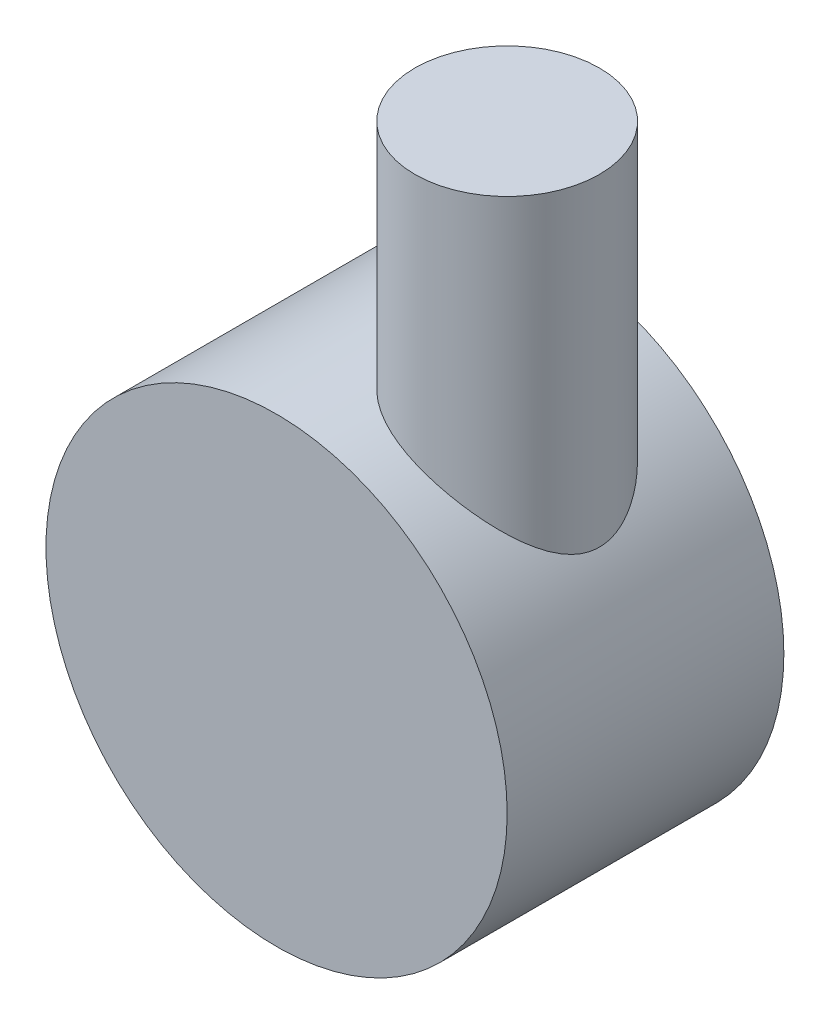
ISO-10303-21;
HEADER;
FILE_DESCRIPTION(('STEP AP214'),'2;1');
FILE_NAME('part.step','',(''),(''),'','','');
FILE_SCHEMA(('AUTOMOTIVE_DESIGN { 1 0 10303 214 1 1 1 1 }'));
ENDSEC;
DATA;
#1=APPLICATION_CONTEXT('core data for automotive mechanical design processes');
#2=APPLICATION_PROTOCOL_DEFINITION('international standard','automotive_design',2000,#1);
#3=PRODUCT_CONTEXT('',#1,'mechanical');
#4=PRODUCT('Part','Part','',(#3));
#5=PRODUCT_RELATED_PRODUCT_CATEGORY('part','',(#4));
#6=PRODUCT_DEFINITION_FORMATION('','',#4);
#7=PRODUCT_DEFINITION_CONTEXT('part definition',#1,'design');
#8=PRODUCT_DEFINITION('design','',#6,#7);
#9=PRODUCT_DEFINITION_SHAPE('','',#8);
#10=(LENGTH_UNIT() NAMED_UNIT(*) SI_UNIT(.MILLI.,.METRE.));
#11=(NAMED_UNIT(*) PLANE_ANGLE_UNIT() SI_UNIT($,.RADIAN.));
#12=(NAMED_UNIT(*) SI_UNIT($,.STERADIAN.) SOLID_ANGLE_UNIT());
#13=UNCERTAINTY_MEASURE_WITH_UNIT(LENGTH_MEASURE(1.E-05),#10,'distance_accuracy_value','');
#14=(GEOMETRIC_REPRESENTATION_CONTEXT(3) GLOBAL_UNCERTAINTY_ASSIGNED_CONTEXT((#13)) GLOBAL_UNIT_ASSIGNED_CONTEXT((#10,
#11,#12)) REPRESENTATION_CONTEXT('',''));
#15=CARTESIAN_POINT('',(0.,0.,0.));
#16=DIRECTION('',(0.,0.,1.));
#17=DIRECTION('',(1.,0.,0.));
#18=AXIS2_PLACEMENT_3D('',#15,#16,#17);
#19=CARTESIAN_POINT('',(0.,0.,30.));
#20=DIRECTION('',(0.,0.,-1.));
#21=DIRECTION('',(-1.,0.,0.));
#22=AXIS2_PLACEMENT_3D('',#19,#20,#21);
#23=CYLINDRICAL_SURFACE('',#22,25.);
#24=CARTESIAN_POINT('',(0.,0.,0.));
#25=DIRECTION('',(0.,0.,1.));
#26=DIRECTION('',(1.,0.,0.));
#27=AXIS2_PLACEMENT_3D('',#24,#25,#26);
#28=CIRCLE('',#27,25.);
#29=CARTESIAN_POINT('',(25.,0.,0.));
#30=VERTEX_POINT('',#29);
#31=EDGE_CURVE('E45',#30,#30,#28,.T.);
#32=ORIENTED_EDGE('',*,*,#31,.T.);
#33=EDGE_LOOP('',(#32));
#34=FACE_BOUND('',#33,.T.);
#35=CARTESIAN_POINT('',(0.,0.,30.));
#36=DIRECTION('',(0.,0.,1.));
#37=DIRECTION('',(1.,0.,0.));
#38=AXIS2_PLACEMENT_3D('',#35,#36,#37);
#39=CIRCLE('',#38,25.);
#40=CARTESIAN_POINT('',(25.,0.,30.));
#41=VERTEX_POINT('',#40);
#42=EDGE_CURVE('E41',#41,#41,#39,.T.);
#43=ORIENTED_EDGE('',*,*,#42,.F.);
#44=EDGE_LOOP('',(#43));
#45=FACE_BOUND('',#44,.T.);
#46=CARTESIAN_POINT('',(10.,22.9128784747792,5.));
#47=CARTESIAN_POINT('',(9.74395274865418,23.0246332525659,4.99999508158958));
#48=CARTESIAN_POINT('',(9.48607902975445,23.1320564122985,5.00983559358378));
#49=CARTESIAN_POINT('',(8.96819070452712,23.337717942223,5.04998592326425));
#50=CARTESIAN_POINT('',(8.70817595497397,23.4359556924302,5.08029712152034));
#51=CARTESIAN_POINT('',(8.18791942694949,23.6227519062562,5.16202649364371));
#52=CARTESIAN_POINT('',(7.92767761374418,23.7113084514143,5.21344884140283));
#53=CARTESIAN_POINT('',(7.40911530519431,23.8784255566922,5.33778513810004));
#54=CARTESIAN_POINT('',(7.15079476522745,23.956986349654,5.41069858629105));
#55=CARTESIAN_POINT('',(6.63763420053793,24.1042165813292,5.5783470512476));
#56=CARTESIAN_POINT('',(6.38280508943463,24.1728595197061,5.67313883514075));
#57=CARTESIAN_POINT('',(5.87963571849291,24.3001489018193,5.88424264824561));
#58=CARTESIAN_POINT('',(5.63129554892842,24.3587952065456,6.00055497666871));
#59=CARTESIAN_POINT('',(5.14342377321489,24.4664587459752,6.25418660270448));
#60=CARTESIAN_POINT('',(4.90389179288228,24.5154763901018,6.39150500666943));
#61=CARTESIAN_POINT('',(4.4358484301732,24.6044712133675,6.6863538318722));
#62=CARTESIAN_POINT('',(4.20733675791638,24.6444486304048,6.84388372106369));
#63=CARTESIAN_POINT('',(3.77222382882678,24.7147115208709,7.17146248080796));
#64=CARTESIAN_POINT('',(3.5651129479655,24.7453186449425,7.34076649460857));
#65=CARTESIAN_POINT('',(3.16464943892371,24.7997143878116,7.69591857548004));
#66=CARTESIAN_POINT('',(2.97129642145454,24.823503199596,7.881766174103));
#67=CARTESIAN_POINT('',(2.59984571501325,24.8651511924953,8.26875510810559));
#68=CARTESIAN_POINT('',(2.42174885604364,24.8830100511465,8.46989727445502));
#69=CARTESIAN_POINT('',(2.0821532878917,24.9137254390399,8.88609421418228));
#70=CARTESIAN_POINT('',(1.92065491953421,24.9265818655799,9.10114927309258));
#71=CARTESIAN_POINT('',(1.61334163370636,24.9483704951518,9.54672564337698));
#72=CARTESIAN_POINT('',(1.46777049381967,24.9572468205724,9.77741781204359));
#73=CARTESIAN_POINT('',(1.19592229118368,24.9717501726439,10.2499971596258));
#74=CARTESIAN_POINT('',(1.06964531974725,24.9773771839174,10.4918843915169));
#75=CARTESIAN_POINT('',(0.837254016077246,24.9862469332782,10.9852224168203));
#76=CARTESIAN_POINT('',(0.731141326829147,24.9894894771409,11.2366739875331));
#77=CARTESIAN_POINT('',(0.539814508538939,24.9943546255284,11.7474223159099));
#78=CARTESIAN_POINT('',(0.45460070039668,24.9959772051801,12.0067191939689));
#79=CARTESIAN_POINT('',(0.303818883036969,24.9982704995468,12.5378589418796));
#80=CARTESIAN_POINT('',(0.238784437884012,24.9989168723248,12.8098535377182));
#81=CARTESIAN_POINT('',(0.131716648618825,24.9997103983013,13.3583358713078));
#82=CARTESIAN_POINT('',(0.0896836742488122,24.999857543475,13.6348236812124));
#83=CARTESIAN_POINT('',(0.0289138305584678,25.0000018026477,14.1903579759888));
#84=CARTESIAN_POINT('',(0.010177765900636,24.9999989114647,14.4694045489034));
#85=CARTESIAN_POINT('',(-0.00386387315887531,25.0000006898979,15.0280859044924));
#86=CARTESIAN_POINT('',(0.00083054374174687,25.0000053595112,15.3077206869484));
#87=CARTESIAN_POINT('',(0.0337154052949025,24.999982706367,15.8672888156708));
#88=CARTESIAN_POINT('',(0.062046504501513,24.9999551916958,16.1472139063603));
#89=CARTESIAN_POINT('',(0.142186774767194,24.9996276942589,16.7036841869424));
#90=CARTESIAN_POINT('',(0.193996097084954,24.9993277097379,16.9802293550481));
#91=CARTESIAN_POINT('',(0.320727905110784,24.9980228120748,17.527987508592));
#92=CARTESIAN_POINT('',(0.39565171168319,24.9970178586436,17.7992001883657));
#93=CARTESIAN_POINT('',(0.568076587653266,24.9936935562444,18.3343436272858));
#94=CARTESIAN_POINT('',(0.665577629051098,24.9913742089065,18.5982743954626));
#95=CARTESIAN_POINT('',(0.882430596719307,24.9846567513175,19.1169054189177));
#96=CARTESIAN_POINT('',(1.0017775561422,24.9802591132239,19.3716077566183));
#97=CARTESIAN_POINT('',(1.26146555688823,24.9684919283459,19.8700076396493));
#98=CARTESIAN_POINT('',(1.40180664176727,24.9611223753957,20.113705162147));
#99=CARTESIAN_POINT('',(1.70242479747288,24.9424220595718,20.5883042165447));
#100=CARTESIAN_POINT('',(1.86270085820941,24.9310914973469,20.8192063959188));
#101=CARTESIAN_POINT('',(2.20195445941364,24.9034204110807,21.2665203035375));
#102=CARTESIAN_POINT('',(2.38093175439566,24.8870799527973,21.4829322219306));
#103=CARTESIAN_POINT('',(2.75404531724813,24.8485412378278,21.8973182696574));
#104=CARTESIAN_POINT('',(2.9479892948464,24.8264106573434,22.0954717972488));
#105=CARTESIAN_POINT('',(3.35116280741475,24.7752091024433,22.4745922686055));
#106=CARTESIAN_POINT('',(3.56039221670149,24.7461381850895,22.6555593536569));
#107=CARTESIAN_POINT('',(3.99228966791369,24.680140213751,22.9989694396401));
#108=CARTESIAN_POINT('',(4.21495415455758,24.6432152316876,23.1614173086605));
#109=CARTESIAN_POINT('',(4.67179642939499,24.5607039624333,23.4667421630612));
#110=CARTESIAN_POINT('',(4.90597394606191,24.5151178794355,23.6096196096953));
#111=CARTESIAN_POINT('',(5.37712485757223,24.4160370679226,23.8712810419954));
#112=CARTESIAN_POINT('',(5.61384302184403,24.3627951296408,23.9906208360291));
#113=CARTESIAN_POINT('',(6.09410870109695,24.2471201804534,24.20943233343));
#114=CARTESIAN_POINT('',(6.33765605692516,24.1846873835949,24.3089044993701));
#115=CARTESIAN_POINT('',(6.82948348168864,24.0504288324105,24.4876914135884));
#116=CARTESIAN_POINT('',(7.07776319429391,23.9786037829203,24.5670076731411));
#117=CARTESIAN_POINT('',(7.57702438796852,23.8255508578537,24.7054780048841));
#118=CARTESIAN_POINT('',(7.82800590594936,23.7443228536678,24.7646318012576));
#119=CARTESIAN_POINT('',(8.33185292477046,23.5722594832219,24.8632391276802));
#120=CARTESIAN_POINT('',(8.58472179903931,23.4813820244073,24.9026016583937));
#121=CARTESIAN_POINT('',(9.08936271921491,23.2906901601945,24.9616908578817));
#122=CARTESIAN_POINT('',(9.34113476814021,23.1908757794079,24.9814175807296));
#123=CARTESIAN_POINT('',(9.84199772501981,22.9827901759487,25.0018936452963));
#124=CARTESIAN_POINT('',(10.0910879397443,22.8745168237198,25.0026381926865));
#125=CARTESIAN_POINT('',(10.5851101827623,22.6501449674866,24.9859274412839));
#126=CARTESIAN_POINT('',(10.8300417003568,22.5340455109934,24.9684699234245));
#127=CARTESIAN_POINT('',(11.3362281404002,22.2839984613635,24.9138778200478));
#128=CARTESIAN_POINT('',(11.5969783052325,22.1493838459887,24.8751197297828));
#129=CARTESIAN_POINT('',(12.1107745568919,21.8726839635874,24.7781896280705));
#130=CARTESIAN_POINT('',(12.3638202546075,21.7305983202241,24.7200166378489));
#131=CARTESIAN_POINT('',(12.8611680957075,21.4399930902089,24.5854099759036));
#132=CARTESIAN_POINT('',(13.1054707435012,21.2914738758228,24.5089773595844));
#133=CARTESIAN_POINT('',(13.5845747716175,20.9890354683963,24.3389214890771));
#134=CARTESIAN_POINT('',(13.8193750437603,20.8351156494154,24.2452962368707));
#135=CARTESIAN_POINT('',(14.3166302463571,20.4972842648155,24.0250930754001));
#136=CARTESIAN_POINT('',(14.5772859836243,20.3126019307803,23.8956282107729));
#137=CARTESIAN_POINT('',(15.0841355852319,19.9391069835223,23.6159945945144));
#138=CARTESIAN_POINT('',(15.3303278735085,19.7502939232447,23.4658235925071));
#139=CARTESIAN_POINT('',(15.8082672082935,19.3698785822733,23.1453684226011));
#140=CARTESIAN_POINT('',(16.0399758041939,19.1782704151523,22.9750339249016));
#141=CARTESIAN_POINT('',(16.4877334498816,18.7947217067157,22.6152355035305));
#142=CARTESIAN_POINT('',(16.7037819146241,18.6027811532565,22.4257708658105));
#143=CARTESIAN_POINT('',(17.1524041040135,18.1907049647092,21.9967174412053));
#144=CARTESIAN_POINT('',(17.3822278483873,17.9708857706338,21.7539327783159));
#145=CARTESIAN_POINT('',(17.8191056982342,17.5377908677891,21.2429691020709));
#146=CARTESIAN_POINT('',(18.0261483364758,17.3245184930561,20.9747774249458));
#147=CARTESIAN_POINT('',(18.4149781350494,16.9106140882536,20.4133462959547));
#148=CARTESIAN_POINT('',(18.5968498076735,16.7099410600277,20.1201962763503));
#149=CARTESIAN_POINT('',(18.9333579718167,16.3276663649453,19.5074625903773));
#150=CARTESIAN_POINT('',(19.0880276603494,16.1460415627106,19.1879118534245));
#151=CARTESIAN_POINT('',(19.3659772447335,15.8115789279219,18.522451791384));
#152=CARTESIAN_POINT('',(19.4893813665267,15.6586278187583,18.1766541087715));
#153=CARTESIAN_POINT('',(19.6472806876957,15.4593532676996,17.639102429716));
#154=CARTESIAN_POINT('',(19.695371111926,15.3979647884125,17.4568216071079));
#155=CARTESIAN_POINT('',(19.7817463802927,15.28683917915,17.0865135370156));
#156=CARTESIAN_POINT('',(19.8200360327816,15.2370963367399,16.8984891582534));
#157=CARTESIAN_POINT('',(19.886469197961,15.1502932062234,16.5152561472572));
#158=CARTESIAN_POINT('',(19.9144829198531,15.1133954363575,16.3199877804574));
#159=CARTESIAN_POINT('',(19.9590169886476,15.0545346396183,15.9258976549048));
#160=CARTESIAN_POINT('',(19.975537890519,15.032570891607,15.7270760682067));
#161=CARTESIAN_POINT('',(19.9966231339882,15.0045119065283,15.3278097242987));
#162=CARTESIAN_POINT('',(20.0011956567653,14.9984058115786,15.1273661720441));
#163=CARTESIAN_POINT('',(19.9982721728689,15.0023037371357,14.7267347789778));
#164=CARTESIAN_POINT('',(19.9907771395091,15.0123064583791,14.5265469188464));
#165=CARTESIAN_POINT('',(19.965757539693,15.0455602383054,14.155331111477));
#166=CARTESIAN_POINT('',(19.9497257142127,15.0668376176094,13.9840194600934));
#167=CARTESIAN_POINT('',(19.9091345865824,15.1204321418829,13.6441315623869));
#168=CARTESIAN_POINT('',(19.8845727151729,15.1527526129966,13.4755561562555));
#169=CARTESIAN_POINT('',(19.7987193626499,15.2649839542951,12.9752921553192));
#170=CARTESIAN_POINT('',(19.7252584341572,15.3601671036439,12.6490417757568));
#171=CARTESIAN_POINT('',(19.5085882083351,15.6351434326781,11.8661135636857));
#172=CARTESIAN_POINT('',(19.3488233598691,15.8336636252182,11.4206792040886));
#173=CARTESIAN_POINT('',(19.0719841946985,16.1641716117304,10.7866110328464));
#174=CARTESIAN_POINT('',(18.9733001815306,16.2800273382293,10.580604782049));
#175=CARTESIAN_POINT('',(18.7644319840241,16.520331973926,10.1796518435617));
#176=CARTESIAN_POINT('',(18.6542478478792,16.6447808471118,9.98470510952976));
#177=CARTESIAN_POINT('',(18.3690289965591,16.9600320765832,9.51677346996898));
#178=CARTESIAN_POINT('',(18.1878178719171,17.1545773092772,9.25007560010521));
#179=CARTESIAN_POINT('',(17.8042110373327,17.5523939664708,8.73930362529875));
#180=CARTESIAN_POINT('',(17.6018059116221,17.7556692455731,8.49523966739974));
#181=CARTESIAN_POINT('',(17.1768661786795,18.1670807569094,8.02919536063701));
#182=CARTESIAN_POINT('',(16.9543118417536,18.3752216022306,7.80723711362116));
#183=CARTESIAN_POINT('',(16.4901553189445,18.7928778425755,7.38579483838895));
#184=CARTESIAN_POINT('',(16.2485561667124,19.0023930138276,7.18630724306669));
#185=CARTESIAN_POINT('',(15.7411459775722,19.4249281771274,6.80597290531021));
#186=CARTESIAN_POINT('',(15.474903070117,19.6379166191462,6.62566641745807));
#187=CARTESIAN_POINT('',(14.9238780195027,20.0598680580042,6.29026638966857));
#188=CARTESIAN_POINT('',(14.6390931918983,20.2688304662652,6.13517651193639));
#189=CARTESIAN_POINT('',(14.0526046421726,20.6797528577756,5.85220598124393));
#190=CARTESIAN_POINT('',(13.7509418448292,20.8817280082562,5.72426283418575));
#191=CARTESIAN_POINT('',(13.1314997323419,21.2767152131802,5.49723887742645));
#192=CARTESIAN_POINT('',(12.8137275372959,21.4697311564233,5.39814544496617));
#193=CARTESIAN_POINT('',(12.0923828006851,21.8856878005721,5.21279901935137));
#194=CARTESIAN_POINT('',(11.6852605080598,22.1059249365757,5.13411054720127));
#195=CARTESIAN_POINT('',(10.853804857406,22.5257962094963,5.02771546712297));
#196=CARTESIAN_POINT('',(10.4294717051932,22.7254305926899,5.00000824971991));
#197=CARTESIAN_POINT('',(10.,22.9128784747792,5.));
#198=B_SPLINE_CURVE_WITH_KNOTS('',3,(#46,#47,#48,#49,#50,#51,#52,#53,#54,#55,#56,#57,#58,#59,
#60,#61,#62,#63,#64,#65,#66,#67,#68,#69,#70,#71,#72,#73,#74,#75,#76,#77,#78,#79,#80,#81,#82,#83,
#84,#85,#86,#87,#88,#89,#90,#91,#92,#93,#94,#95,#96,#97,#98,#99,#100,#101,#102,#103,#104,#105,
#106,#107,#108,#109,#110,#111,#112,#113,#114,#115,#116,#117,#118,#119,#120,#121,#122,#123,#124,
#125,#126,#127,#128,#129,#130,#131,#132,#133,#134,#135,#136,#137,#138,#139,#140,#141,#142,#143,
#144,#145,#146,#147,#148,#149,#150,#151,#152,#153,#154,#155,#156,#157,#158,#159,#160,#161,#162,
#163,#164,#165,#166,#167,#168,#169,#170,#171,#172,#173,#174,#175,#176,#177,#178,#179,#180,#181,
#182,#183,#184,#185,#186,#187,#188,#189,#190,#191,#192,#193,#194,#195,#196,#197),.UNSPECIFIED.,
.T.,.F.,(4,2,2,2,2,2,2,2,2,2,2,2,2,2,2,2,2,2,2,2,2,2,2,2,2,2,2,2,2,2,2,2,2,2,2,2,2,2,2,2,2,2,2,
2,2,2,2,2,2,2,2,2,2,2,2,2,2,2,2,2,2,2,2,2,2,2,2,2,2,2,2,2,2,2,2,4),(0.,0.837788159371604,
1.67563282591446,2.51364322281906,3.35163409545173,4.19182422231219,5.03202603165398,
5.87219210677559,6.71233606993501,7.51914069018817,8.32592247223642,9.1327481189423,
9.93959032928129,10.7574301798282,11.5752739008194,12.3931842311611,13.2111071196332,
14.049106621251,14.8871195930809,15.7251615086159,16.5632031130589,17.4062675107335,
18.2493373399363,19.0924553548216,19.9355723240944,20.7784978414129,21.6214251075489,
22.4643096805881,23.3071831907145,24.1406139291886,24.9740378156107,25.8072421148552,
26.6404267729885,27.450632642352,28.2608196457005,29.0709458839102,29.8810832039749,
30.694912192494,31.5087389398645,32.3227712334433,33.1369027796749,34.0240095999085,
34.9111611491185,35.798261433462,36.6854648762592,37.7185171790472,38.7516818442332,
39.7874820252978,40.8233208827681,42.0221707422132,43.2216213274088,44.4169415993948,
45.6107928369353,46.7998234649034,47.3940561661109,47.9879967698387,48.5892000031416,
49.190374203328,49.791136665305,50.3918506749593,50.9113608021999,51.4310275423876,
52.4702893438946,54.0007951315262,54.7687428555973,55.536687361554,56.6648436942158,
57.7935033718274,58.9232804159102,60.0528778599134,61.2086987503204,62.3646873508086,
63.5179851788286,64.6707776377388,66.0760284616632,67.4812624858709),.UNSPECIFIED.);
#199=CARTESIAN_POINT('',(10.,22.9128784747792,5.));
#200=VERTEX_POINT('',#199);
#201=EDGE_CURVE('E10',#200,#200,#198,.T.);
#202=ORIENTED_EDGE('',*,*,#201,.F.);
#203=EDGE_LOOP('',(#202));
#204=FACE_BOUND('',#203,.T.);
#205=ADVANCED_FACE('F31',(#34,#45,#204),#23,.T.);
#206=CARTESIAN_POINT('',(0.,0.,30.));
#207=DIRECTION('',(0.,0.,1.));
#208=DIRECTION('',(1.,0.,0.));
#209=AXIS2_PLACEMENT_3D('',#206,#207,#208);
#210=PLANE('',#209);
#211=ORIENTED_EDGE('',*,*,#42,.T.);
#212=EDGE_LOOP('',(#211));
#213=FACE_BOUND('',#212,.T.);
#214=ADVANCED_FACE('F65',(#213),#210,.T.);
#215=CARTESIAN_POINT('',(0.,0.,0.));
#216=DIRECTION('',(0.,0.,1.));
#217=DIRECTION('',(1.,0.,0.));
#218=AXIS2_PLACEMENT_3D('',#215,#216,#217);
#219=PLANE('',#218);
#220=ORIENTED_EDGE('',*,*,#31,.F.);
#221=EDGE_LOOP('',(#220));
#222=FACE_BOUND('',#221,.T.);
#223=ADVANCED_FACE('F59',(#222),#219,.F.);
#224=CARTESIAN_POINT('',(10.,50.,15.));
#225=DIRECTION('',(0.,-1.,0.));
#226=DIRECTION('',(0.,0.,-1.));
#227=AXIS2_PLACEMENT_3D('',#224,#225,#226);
#228=CYLINDRICAL_SURFACE('',#227,10.);
#229=CARTESIAN_POINT('',(10.,50.,15.));
#230=DIRECTION('',(0.,1.,0.));
#231=DIRECTION('',(0.,0.,1.));
#232=AXIS2_PLACEMENT_3D('',#229,#230,#231);
#233=CIRCLE('',#232,10.);
#234=CARTESIAN_POINT('',(10.,50.,25.));
#235=VERTEX_POINT('',#234);
#236=EDGE_CURVE('E50',#235,#235,#233,.T.);
#237=ORIENTED_EDGE('',*,*,#236,.F.);
#238=EDGE_LOOP('',(#237));
#239=FACE_BOUND('',#238,.T.);
#240=ORIENTED_EDGE('',*,*,#201,.T.);
#241=EDGE_LOOP('',(#240));
#242=FACE_BOUND('',#241,.T.);
#243=ADVANCED_FACE('F57',(#239,#242),#228,.T.);
#244=CARTESIAN_POINT('',(10.,50.,15.));
#245=DIRECTION('',(0.,1.,0.));
#246=DIRECTION('',(0.,0.,1.));
#247=AXIS2_PLACEMENT_3D('',#244,#245,#246);
#248=PLANE('',#247);
#249=ORIENTED_EDGE('',*,*,#236,.T.);
#250=EDGE_LOOP('',(#249));
#251=FACE_BOUND('',#250,.T.);
#252=ADVANCED_FACE('F55',(#251),#248,.T.);
#253=CLOSED_SHELL('',(#205,#214,#223,#243,#252));
#254=MANIFOLD_SOLID_BREP('B2',#253);
#255=ADVANCED_BREP_SHAPE_REPRESENTATION('',(#18,#254),#14);
#256=SHAPE_DEFINITION_REPRESENTATION(#9,#255);
ENDSEC;
END-ISO-10303-21;
